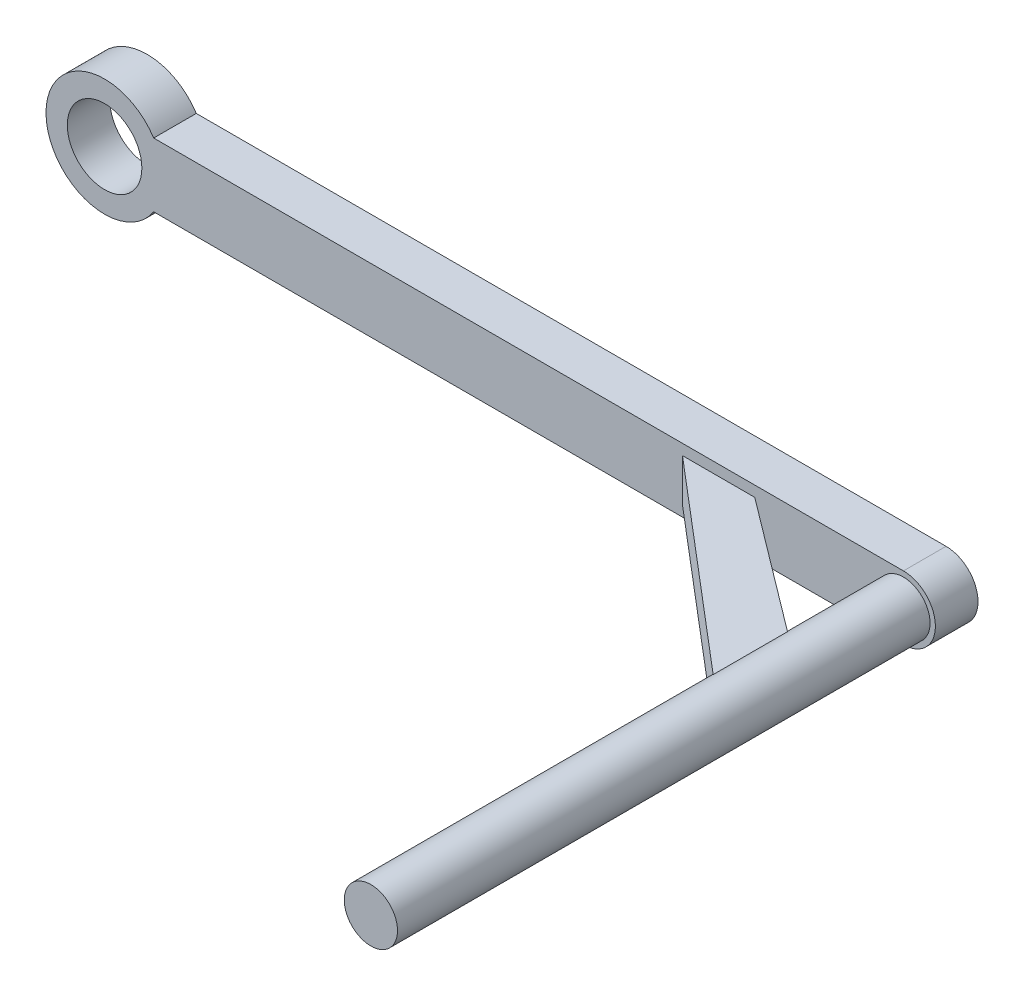
ISO-10303-21;
HEADER;
FILE_DESCRIPTION(('STEP AP214'),'2;1');
FILE_NAME('part.step','',(''),(''),'','','');
FILE_SCHEMA(('AUTOMOTIVE_DESIGN { 1 0 10303 214 1 1 1 1 }'));
ENDSEC;
DATA;
#1=APPLICATION_CONTEXT('core data for automotive mechanical design processes');
#2=APPLICATION_PROTOCOL_DEFINITION('international standard','automotive_design',2000,#1);
#3=PRODUCT_CONTEXT('',#1,'mechanical');
#4=PRODUCT('Part','Part','',(#3));
#5=PRODUCT_RELATED_PRODUCT_CATEGORY('part','',(#4));
#6=PRODUCT_DEFINITION_FORMATION('','',#4);
#7=PRODUCT_DEFINITION_CONTEXT('part definition',#1,'design');
#8=PRODUCT_DEFINITION('design','',#6,#7);
#9=PRODUCT_DEFINITION_SHAPE('','',#8);
#10=(LENGTH_UNIT() NAMED_UNIT(*) SI_UNIT(.MILLI.,.METRE.));
#11=(NAMED_UNIT(*) PLANE_ANGLE_UNIT() SI_UNIT($,.RADIAN.));
#12=(NAMED_UNIT(*) SI_UNIT($,.STERADIAN.) SOLID_ANGLE_UNIT());
#13=UNCERTAINTY_MEASURE_WITH_UNIT(LENGTH_MEASURE(1.E-05),#10,'distance_accuracy_value','');
#14=(GEOMETRIC_REPRESENTATION_CONTEXT(3) GLOBAL_UNCERTAINTY_ASSIGNED_CONTEXT((#13)) GLOBAL_UNIT_ASSIGNED_CONTEXT((#10,
#11,#12)) REPRESENTATION_CONTEXT('',''));
#15=CARTESIAN_POINT('',(0.,0.,0.));
#16=DIRECTION('',(0.,0.,1.));
#17=DIRECTION('',(1.,0.,0.));
#18=AXIS2_PLACEMENT_3D('',#15,#16,#17);
#19=CARTESIAN_POINT('',(0.,0.,4.));
#20=DIRECTION('',(0.,0.,1.));
#21=DIRECTION('',(1.,0.,0.));
#22=AXIS2_PLACEMENT_3D('',#19,#20,#21);
#23=PLANE('',#22);
#24=CARTESIAN_POINT('',(0.,0.,4.));
#25=DIRECTION('',(0.,0.,1.));
#26=DIRECTION('',(1.,0.,0.));
#27=AXIS2_PLACEMENT_3D('',#24,#25,#26);
#28=CIRCLE('',#27,2.5);
#29=CARTESIAN_POINT('',(2.5,0.,4.));
#30=VERTEX_POINT('',#29);
#31=EDGE_CURVE('E118',#30,#30,#28,.T.);
#32=ORIENTED_EDGE('',*,*,#31,.F.);
#33=EDGE_LOOP('',(#32));
#34=FACE_BOUND('',#33,.T.);
#35=DIRECTION('',(-1.,0.,0.));
#36=VECTOR('',#35,1.);
#37=CARTESIAN_POINT('',(0.,3.,4.));
#38=LINE('',#37,#36);
#39=CARTESIAN_POINT('',(0.,3.,4.));
#40=VERTEX_POINT('',#39);
#41=CARTESIAN_POINT('',(-70.3902277713536,2.99999999999999,4.));
#42=VERTEX_POINT('',#41);
#43=EDGE_CURVE('E153',#40,#42,#38,.T.);
#44=ORIENTED_EDGE('',*,*,#43,.T.);
#45=CARTESIAN_POINT('',(-75.,0.,4.));
#46=DIRECTION('',(0.,0.,1.));
#47=DIRECTION('',(1.,0.,0.));
#48=AXIS2_PLACEMENT_3D('',#45,#46,#47);
#49=CIRCLE('',#48,5.5);
#50=CARTESIAN_POINT('',(-70.3902277713536,-3.00000000000001,4.));
#51=VERTEX_POINT('',#50);
#52=EDGE_CURVE('E156',#42,#51,#49,.T.);
#53=ORIENTED_EDGE('',*,*,#52,.T.);
#54=DIRECTION('',(-1.,0.,0.));
#55=VECTOR('',#54,1.);
#56=CARTESIAN_POINT('',(0.,-3.,4.));
#57=LINE('',#56,#55);
#58=CARTESIAN_POINT('',(0.,-3.,4.));
#59=VERTEX_POINT('',#58);
#60=EDGE_CURVE('E159',#59,#51,#57,.T.);
#61=ORIENTED_EDGE('',*,*,#60,.F.);
#62=CARTESIAN_POINT('',(0.,0.,4.));
#63=DIRECTION('',(0.,0.,1.));
#64=DIRECTION('',(1.,0.,0.));
#65=AXIS2_PLACEMENT_3D('',#62,#63,#64);
#66=CIRCLE('',#65,3.);
#67=EDGE_CURVE('E162',#59,#40,#66,.T.);
#68=ORIENTED_EDGE('',*,*,#67,.T.);
#69=EDGE_LOOP('',(#44,#53,#61,#68));
#70=FACE_BOUND('',#69,.T.);
#71=CARTESIAN_POINT('',(-75.,0.,4.));
#72=DIRECTION('',(0.,0.,1.));
#73=DIRECTION('',(1.,0.,0.));
#74=AXIS2_PLACEMENT_3D('',#71,#72,#73);
#75=CIRCLE('',#74,3.50000000000001);
#76=CARTESIAN_POINT('',(-71.5,0.,4.));
#77=VERTEX_POINT('',#76);
#78=EDGE_CURVE('E147',#77,#77,#75,.T.);
#79=ORIENTED_EDGE('',*,*,#78,.F.);
#80=EDGE_LOOP('',(#79));
#81=FACE_BOUND('',#80,.T.);
#82=DIRECTION('',(0.,1.,0.));
#83=VECTOR('',#82,1.);
#84=CARTESIAN_POINT('',(-13.9584040357201,0.,4.));
#85=LINE('',#84,#83);
#86=CARTESIAN_POINT('',(-13.9584040357201,-2.,4.));
#87=VERTEX_POINT('',#86);
#88=CARTESIAN_POINT('',(-13.9584040357201,2.,4.));
#89=VERTEX_POINT('',#88);
#90=EDGE_CURVE('E72',#87,#89,#85,.T.);
#91=ORIENTED_EDGE('',*,*,#90,.F.);
#92=DIRECTION('',(-1.,0.,0.));
#93=VECTOR('',#92,1.);
#94=CARTESIAN_POINT('',(0.,-2.,4.));
#95=LINE('',#94,#93);
#96=CARTESIAN_POINT('',(-20.7452559755301,-2.,4.));
#97=VERTEX_POINT('',#96);
#98=EDGE_CURVE('E67',#87,#97,#95,.T.);
#99=ORIENTED_EDGE('',*,*,#98,.T.);
#100=DIRECTION('',(0.,-1.,0.));
#101=VECTOR('',#100,1.);
#102=CARTESIAN_POINT('',(-20.7452559755301,0.,4.));
#103=LINE('',#102,#101);
#104=CARTESIAN_POINT('',(-20.7452559755301,2.,4.));
#105=VERTEX_POINT('',#104);
#106=EDGE_CURVE('E111',#105,#97,#103,.T.);
#107=ORIENTED_EDGE('',*,*,#106,.F.);
#108=DIRECTION('',(-1.,0.,0.));
#109=VECTOR('',#108,1.);
#110=CARTESIAN_POINT('',(0.,2.,4.));
#111=LINE('',#110,#109);
#112=EDGE_CURVE('E113',#89,#105,#111,.T.);
#113=ORIENTED_EDGE('',*,*,#112,.F.);
#114=EDGE_LOOP('',(#91,#99,#107,#113));
#115=FACE_BOUND('',#114,.T.);
#116=ADVANCED_FACE('F52',(#34,#70,#81,#115),#23,.T.);
#117=CARTESIAN_POINT('',(0.,0.,54.));
#118=DIRECTION('',(0.,0.,-1.));
#119=DIRECTION('',(-1.,0.,0.));
#120=AXIS2_PLACEMENT_3D('',#117,#118,#119);
#121=CYLINDRICAL_SURFACE('',#120,2.5);
#122=ORIENTED_EDGE('',*,*,#31,.T.);
#123=EDGE_LOOP('',(#122));
#124=FACE_BOUND('',#123,.T.);
#125=CARTESIAN_POINT('',(0.,0.,54.));
#126=DIRECTION('',(0.,0.,1.));
#127=DIRECTION('',(1.,0.,0.));
#128=AXIS2_PLACEMENT_3D('',#125,#126,#127);
#129=CIRCLE('',#128,2.5);
#130=CARTESIAN_POINT('',(2.5,0.,54.));
#131=VERTEX_POINT('',#130);
#132=EDGE_CURVE('E141',#131,#131,#129,.T.);
#133=ORIENTED_EDGE('',*,*,#132,.F.);
#134=EDGE_LOOP('',(#133));
#135=FACE_BOUND('',#134,.T.);
#136=DIRECTION('',(0.,0.,-1.));
#137=VECTOR('',#136,1.);
#138=CARTESIAN_POINT('',(-1.5,-2.,54.));
#139=LINE('',#138,#137);
#140=CARTESIAN_POINT('',(-1.5,-2.,13.3848810830848));
#141=VERTEX_POINT('',#140);
#142=CARTESIAN_POINT('',(-1.5,-2.,20.3636332305055));
#143=VERTEX_POINT('',#142);
#144=EDGE_CURVE('E12',#141,#143,#139,.F.);
#145=ORIENTED_EDGE('',*,*,#144,.F.);
#146=CARTESIAN_POINT('',(0.,0.,14.5148269079485));
#147=DIRECTION('',(0.601684171870458,0.,-0.798734096755961));
#148=DIRECTION('',(-0.798734096755961,0.,-0.601684171870458));
#149=AXIS2_PLACEMENT_3D('',#146,#147,#148);
#150=ELLIPSE('',#149,3.12995277170924,2.5);
#151=CARTESIAN_POINT('',(-1.5,2.,13.3848810830848));
#152=VERTEX_POINT('',#151);
#153=EDGE_CURVE('E185',#141,#152,#150,.T.);
#154=ORIENTED_EDGE('',*,*,#153,.T.);
#155=DIRECTION('',(0.,0.,-1.));
#156=VECTOR('',#155,1.);
#157=CARTESIAN_POINT('',(-1.5,2.,54.));
#158=LINE('',#157,#156);
#159=CARTESIAN_POINT('',(-1.5,2.,20.3636332305055));
#160=VERTEX_POINT('',#159);
#161=EDGE_CURVE('E183',#152,#160,#158,.F.);
#162=ORIENTED_EDGE('',*,*,#161,.T.);
#163=CARTESIAN_POINT('',(0.,0.,21.6390358480112));
#164=DIRECTION('',(-0.647767127077955,0.,0.761838400894292));
#165=DIRECTION('',(-0.761838400894292,0.,-0.647767127077955));
#166=AXIS2_PLACEMENT_3D('',#163,#164,#165);
#167=ELLIPSE('',#166,3.28153581791801,2.5);
#168=EDGE_CURVE('E60',#160,#143,#167,.T.);
#169=ORIENTED_EDGE('',*,*,#168,.T.);
#170=EDGE_LOOP('',(#145,#154,#162,#169));
#171=FACE_BOUND('',#170,.T.);
#172=ADVANCED_FACE('F189',(#124,#135,#171),#121,.T.);
#173=CARTESIAN_POINT('',(0.,0.,0.));
#174=DIRECTION('',(0.,0.,1.));
#175=DIRECTION('',(1.,0.,0.));
#176=AXIS2_PLACEMENT_3D('',#173,#174,#175);
#177=PLANE('',#176);
#178=DIRECTION('',(-1.,0.,0.));
#179=VECTOR('',#178,1.);
#180=CARTESIAN_POINT('',(0.,3.,0.));
#181=LINE('',#180,#179);
#182=CARTESIAN_POINT('',(0.,3.,0.));
#183=VERTEX_POINT('',#182);
#184=CARTESIAN_POINT('',(-70.3902277713536,2.99999999999999,0.));
#185=VERTEX_POINT('',#184);
#186=EDGE_CURVE('E150',#183,#185,#181,.T.);
#187=ORIENTED_EDGE('',*,*,#186,.F.);
#188=CARTESIAN_POINT('',(0.,0.,0.));
#189=DIRECTION('',(0.,0.,1.));
#190=DIRECTION('',(1.,0.,0.));
#191=AXIS2_PLACEMENT_3D('',#188,#189,#190);
#192=CIRCLE('',#191,3.);
#193=CARTESIAN_POINT('',(0.,-3.,0.));
#194=VERTEX_POINT('',#193);
#195=EDGE_CURVE('E157',#194,#183,#192,.T.);
#196=ORIENTED_EDGE('',*,*,#195,.F.);
#197=DIRECTION('',(-1.,0.,0.));
#198=VECTOR('',#197,1.);
#199=CARTESIAN_POINT('',(0.,-3.,0.));
#200=LINE('',#199,#198);
#201=CARTESIAN_POINT('',(-70.3902277713536,-3.00000000000001,0.));
#202=VERTEX_POINT('',#201);
#203=EDGE_CURVE('E170',#194,#202,#200,.T.);
#204=ORIENTED_EDGE('',*,*,#203,.T.);
#205=CARTESIAN_POINT('',(-75.,0.,0.));
#206=DIRECTION('',(0.,0.,1.));
#207=DIRECTION('',(1.,0.,0.));
#208=AXIS2_PLACEMENT_3D('',#205,#206,#207);
#209=CIRCLE('',#208,5.5);
#210=EDGE_CURVE('E167',#185,#202,#209,.T.);
#211=ORIENTED_EDGE('',*,*,#210,.F.);
#212=EDGE_LOOP('',(#187,#196,#204,#211));
#213=FACE_BOUND('',#212,.T.);
#214=CARTESIAN_POINT('',(-75.,0.,0.));
#215=DIRECTION('',(0.,0.,1.));
#216=DIRECTION('',(1.,0.,0.));
#217=AXIS2_PLACEMENT_3D('',#214,#215,#216);
#218=CIRCLE('',#217,3.50000000000001);
#219=CARTESIAN_POINT('',(-71.5,0.,0.));
#220=VERTEX_POINT('',#219);
#221=EDGE_CURVE('E144',#220,#220,#218,.T.);
#222=ORIENTED_EDGE('',*,*,#221,.T.);
#223=EDGE_LOOP('',(#222));
#224=FACE_BOUND('',#223,.T.);
#225=ADVANCED_FACE('F210',(#213,#224),#177,.F.);
#226=CARTESIAN_POINT('',(0.,3.,4.));
#227=DIRECTION('',(0.,-1.,0.));
#228=DIRECTION('',(1.,0.,0.));
#229=AXIS2_PLACEMENT_3D('',#226,#227,#228);
#230=PLANE('',#229);
#231=ORIENTED_EDGE('',*,*,#186,.T.);
#232=DIRECTION('',(0.,0.,-1.));
#233=VECTOR('',#232,1.);
#234=CARTESIAN_POINT('',(-70.3902277713536,2.99999999999999,4.));
#235=LINE('',#234,#233);
#236=EDGE_CURVE('E180',#42,#185,#235,.T.);
#237=ORIENTED_EDGE('',*,*,#236,.F.);
#238=ORIENTED_EDGE('',*,*,#43,.F.);
#239=DIRECTION('',(0.,0.,-1.));
#240=VECTOR('',#239,1.);
#241=CARTESIAN_POINT('',(0.,3.,4.));
#242=LINE('',#241,#240);
#243=EDGE_CURVE('E164',#40,#183,#242,.T.);
#244=ORIENTED_EDGE('',*,*,#243,.T.);
#245=EDGE_LOOP('',(#231,#237,#238,#244));
#246=FACE_BOUND('',#245,.T.);
#247=ADVANCED_FACE('F54',(#246),#230,.F.);
#248=CARTESIAN_POINT('',(-75.,0.,4.));
#249=DIRECTION('',(0.,0.,-1.));
#250=DIRECTION('',(-1.,0.,0.));
#251=AXIS2_PLACEMENT_3D('',#248,#249,#250);
#252=CYLINDRICAL_SURFACE('',#251,5.5);
#253=ORIENTED_EDGE('',*,*,#210,.T.);
#254=DIRECTION('',(0.,0.,-1.));
#255=VECTOR('',#254,1.);
#256=CARTESIAN_POINT('',(-70.3902277713536,-3.00000000000001,4.));
#257=LINE('',#256,#255);
#258=EDGE_CURVE('E178',#51,#202,#257,.T.);
#259=ORIENTED_EDGE('',*,*,#258,.F.);
#260=ORIENTED_EDGE('',*,*,#52,.F.);
#261=ORIENTED_EDGE('',*,*,#236,.T.);
#262=EDGE_LOOP('',(#253,#259,#260,#261));
#263=FACE_BOUND('',#262,.T.);
#264=ADVANCED_FACE('F227',(#263),#252,.T.);
#265=CARTESIAN_POINT('',(0.,-3.,4.));
#266=DIRECTION('',(0.,-1.,0.));
#267=DIRECTION('',(1.,0.,0.));
#268=AXIS2_PLACEMENT_3D('',#265,#266,#267);
#269=PLANE('',#268);
#270=ORIENTED_EDGE('',*,*,#203,.F.);
#271=DIRECTION('',(0.,0.,-1.));
#272=VECTOR('',#271,1.);
#273=CARTESIAN_POINT('',(0.,-3.,4.));
#274=LINE('',#273,#272);
#275=EDGE_CURVE('E176',#59,#194,#274,.T.);
#276=ORIENTED_EDGE('',*,*,#275,.F.);
#277=ORIENTED_EDGE('',*,*,#60,.T.);
#278=ORIENTED_EDGE('',*,*,#258,.T.);
#279=EDGE_LOOP('',(#270,#276,#277,#278));
#280=FACE_BOUND('',#279,.T.);
#281=ADVANCED_FACE('F224',(#280),#269,.T.);
#282=CARTESIAN_POINT('',(0.,0.,4.));
#283=DIRECTION('',(0.,0.,-1.));
#284=DIRECTION('',(-1.,0.,0.));
#285=AXIS2_PLACEMENT_3D('',#282,#283,#284);
#286=CYLINDRICAL_SURFACE('',#285,3.);
#287=ORIENTED_EDGE('',*,*,#195,.T.);
#288=ORIENTED_EDGE('',*,*,#243,.F.);
#289=ORIENTED_EDGE('',*,*,#67,.F.);
#290=ORIENTED_EDGE('',*,*,#275,.T.);
#291=EDGE_LOOP('',(#287,#288,#289,#290));
#292=FACE_BOUND('',#291,.T.);
#293=ADVANCED_FACE('F221',(#292),#286,.T.);
#294=CARTESIAN_POINT('',(-75.,0.,4.));
#295=DIRECTION('',(0.,0.,-1.));
#296=DIRECTION('',(-1.,0.,0.));
#297=AXIS2_PLACEMENT_3D('',#294,#295,#296);
#298=CYLINDRICAL_SURFACE('',#297,3.50000000000001);
#299=ORIENTED_EDGE('',*,*,#78,.T.);
#300=EDGE_LOOP('',(#299));
#301=FACE_BOUND('',#300,.T.);
#302=ORIENTED_EDGE('',*,*,#221,.F.);
#303=EDGE_LOOP('',(#302));
#304=FACE_BOUND('',#303,.T.);
#305=ADVANCED_FACE('F217',(#301,#304),#298,.F.);
#306=CARTESIAN_POINT('',(0.,0.,54.));
#307=DIRECTION('',(0.,0.,1.));
#308=DIRECTION('',(1.,0.,0.));
#309=AXIS2_PLACEMENT_3D('',#306,#307,#308);
#310=PLANE('',#309);
#311=ORIENTED_EDGE('',*,*,#132,.T.);
#312=EDGE_LOOP('',(#311));
#313=FACE_BOUND('',#312,.T.);
#314=ADVANCED_FACE('F250',(#313),#310,.T.);
#315=CARTESIAN_POINT('',(0.,-2.,21.6390358480112));
#316=DIRECTION('',(-0.647767127077955,0.,0.761838400894292));
#317=DIRECTION('',(0.761838400894292,0.,0.647767127077955));
#318=AXIS2_PLACEMENT_3D('',#315,#316,#317);
#319=PLANE('',#318);
#320=DIRECTION('',(0.761838400894292,0.,0.647767127077955));
#321=VECTOR('',#320,1.);
#322=CARTESIAN_POINT('',(0.,2.,21.6390358480112));
#323=LINE('',#322,#321);
#324=EDGE_CURVE('E123',#105,#160,#323,.T.);
#325=ORIENTED_EDGE('',*,*,#324,.F.);
#326=ORIENTED_EDGE('',*,*,#106,.T.);
#327=DIRECTION('',(0.761838400894292,0.,0.647767127077955));
#328=VECTOR('',#327,1.);
#329=CARTESIAN_POINT('',(0.,-2.,21.6390358480112));
#330=LINE('',#329,#328);
#331=EDGE_CURVE('E133',#97,#143,#330,.T.);
#332=ORIENTED_EDGE('',*,*,#331,.T.);
#333=ORIENTED_EDGE('',*,*,#168,.F.);
#334=EDGE_LOOP('',(#325,#326,#332,#333));
#335=FACE_BOUND('',#334,.T.);
#336=ADVANCED_FACE('F129',(#335),#319,.T.);
#337=CARTESIAN_POINT('',(-16.0822921117187,-2.,2.40008102403166));
#338=DIRECTION('',(0.601684171870458,0.,-0.798734096755961));
#339=DIRECTION('',(-0.798734096755961,0.,-0.601684171870458));
#340=AXIS2_PLACEMENT_3D('',#337,#338,#339);
#341=PLANE('',#340);
#342=DIRECTION('',(-0.798734096755961,0.,-0.601684171870458));
#343=VECTOR('',#342,1.);
#344=CARTESIAN_POINT('',(-16.0822921117187,-2.,2.40008102403166));
#345=LINE('',#344,#343);
#346=EDGE_CURVE('E127',#141,#87,#345,.T.);
#347=ORIENTED_EDGE('',*,*,#346,.T.);
#348=ORIENTED_EDGE('',*,*,#90,.T.);
#349=DIRECTION('',(-0.798734096755961,0.,-0.601684171870458));
#350=VECTOR('',#349,1.);
#351=CARTESIAN_POINT('',(-16.0822921117187,2.,2.40008102403166));
#352=LINE('',#351,#350);
#353=EDGE_CURVE('E126',#152,#89,#352,.T.);
#354=ORIENTED_EDGE('',*,*,#353,.F.);
#355=ORIENTED_EDGE('',*,*,#153,.F.);
#356=EDGE_LOOP('',(#347,#348,#354,#355));
#357=FACE_BOUND('',#356,.T.);
#358=ADVANCED_FACE('F191',(#357),#341,.T.);
#359=CARTESIAN_POINT('',(0.,-2.,0.));
#360=DIRECTION('',(0.,1.,0.));
#361=DIRECTION('',(-1.,0.,0.));
#362=AXIS2_PLACEMENT_3D('',#359,#360,#361);
#363=PLANE('',#362);
#364=ORIENTED_EDGE('',*,*,#98,.F.);
#365=ORIENTED_EDGE('',*,*,#346,.F.);
#366=ORIENTED_EDGE('',*,*,#144,.T.);
#367=ORIENTED_EDGE('',*,*,#331,.F.);
#368=EDGE_LOOP('',(#364,#365,#366,#367));
#369=FACE_BOUND('',#368,.T.);
#370=ADVANCED_FACE('F194',(#369),#363,.F.);
#371=CARTESIAN_POINT('',(0.,2.,0.));
#372=DIRECTION('',(0.,1.,0.));
#373=DIRECTION('',(-1.,0.,0.));
#374=AXIS2_PLACEMENT_3D('',#371,#372,#373);
#375=PLANE('',#374);
#376=ORIENTED_EDGE('',*,*,#353,.T.);
#377=ORIENTED_EDGE('',*,*,#112,.T.);
#378=ORIENTED_EDGE('',*,*,#324,.T.);
#379=ORIENTED_EDGE('',*,*,#161,.F.);
#380=EDGE_LOOP('',(#376,#377,#378,#379));
#381=FACE_BOUND('',#380,.T.);
#382=ADVANCED_FACE('F122',(#381),#375,.T.);
#383=CLOSED_SHELL('',(#116,#172,#225,#247,#264,#281,#293,#305,#314,#336,#358,#370,#382));
#384=MANIFOLD_SOLID_BREP('B2',#383);
#385=ADVANCED_BREP_SHAPE_REPRESENTATION('',(#18,#384),#14);
#386=SHAPE_DEFINITION_REPRESENTATION(#9,#385);
ENDSEC;
END-ISO-10303-21;
